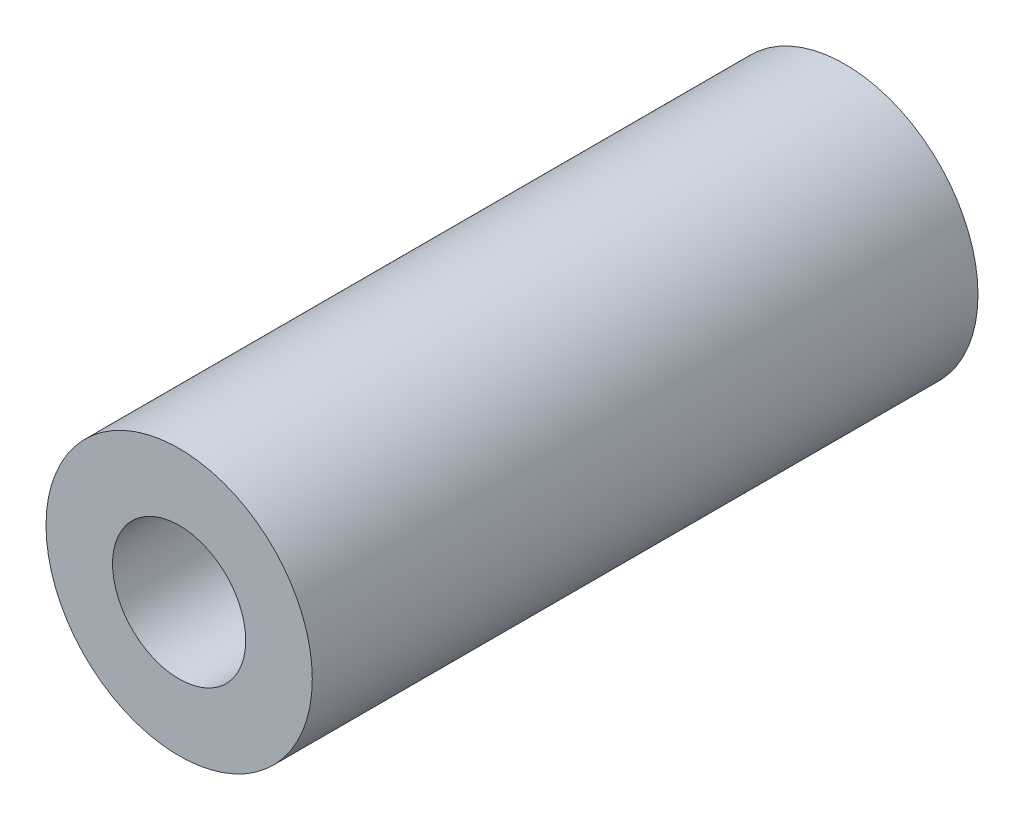
ISO-10303-21;
HEADER;
FILE_DESCRIPTION(('STEP AP214'),'2;1');
FILE_NAME('part.step','',(''),(''),'','','');
FILE_SCHEMA(('AUTOMOTIVE_DESIGN { 1 0 10303 214 1 1 1 1 }'));
ENDSEC;
DATA;
#1=APPLICATION_CONTEXT('core data for automotive mechanical design processes');
#2=APPLICATION_PROTOCOL_DEFINITION('international standard','automotive_design',2000,#1);
#3=PRODUCT_CONTEXT('',#1,'mechanical');
#4=PRODUCT('Part','Part','',(#3));
#5=PRODUCT_RELATED_PRODUCT_CATEGORY('part','',(#4));
#6=PRODUCT_DEFINITION_FORMATION('','',#4);
#7=PRODUCT_DEFINITION_CONTEXT('part definition',#1,'design');
#8=PRODUCT_DEFINITION('design','',#6,#7);
#9=PRODUCT_DEFINITION_SHAPE('','',#8);
#10=(LENGTH_UNIT() NAMED_UNIT(*) SI_UNIT(.MILLI.,.METRE.));
#11=(NAMED_UNIT(*) PLANE_ANGLE_UNIT() SI_UNIT($,.RADIAN.));
#12=(NAMED_UNIT(*) SI_UNIT($,.STERADIAN.) SOLID_ANGLE_UNIT());
#13=UNCERTAINTY_MEASURE_WITH_UNIT(LENGTH_MEASURE(1.E-05),#10,'distance_accuracy_value','');
#14=(GEOMETRIC_REPRESENTATION_CONTEXT(3) GLOBAL_UNCERTAINTY_ASSIGNED_CONTEXT((#13)) GLOBAL_UNIT_ASSIGNED_CONTEXT((#10,
#11,#12)) REPRESENTATION_CONTEXT('',''));
#15=CARTESIAN_POINT('',(0.,0.,0.));
#16=DIRECTION('',(0.,0.,1.));
#17=DIRECTION('',(1.,0.,0.));
#18=AXIS2_PLACEMENT_3D('',#15,#16,#17);
#19=CARTESIAN_POINT('',(0.,0.,25.));
#20=DIRECTION('',(0.,0.,1.));
#21=DIRECTION('',(1.,0.,0.));
#22=AXIS2_PLACEMENT_3D('',#19,#20,#21);
#23=CYLINDRICAL_SURFACE('',#22,10.);
#24=CARTESIAN_POINT('',(0.,0.,-25.));
#25=DIRECTION('',(0.,0.,1.));
#26=DIRECTION('',(1.,0.,0.));
#27=AXIS2_PLACEMENT_3D('',#24,#25,#26);
#28=CIRCLE('',#27,10.);
#29=CARTESIAN_POINT('',(10.,0.,-25.));
#30=VERTEX_POINT('',#29);
#31=EDGE_CURVE('E10',#30,#30,#28,.T.);
#32=ORIENTED_EDGE('',*,*,#31,.T.);
#33=EDGE_LOOP('',(#32));
#34=FACE_BOUND('',#33,.T.);
#35=CARTESIAN_POINT('',(0.,0.,25.));
#36=DIRECTION('',(0.,0.,1.));
#37=DIRECTION('',(1.,0.,0.));
#38=AXIS2_PLACEMENT_3D('',#35,#36,#37);
#39=CIRCLE('',#38,10.);
#40=CARTESIAN_POINT('',(10.,0.,25.));
#41=VERTEX_POINT('',#40);
#42=EDGE_CURVE('E45',#41,#41,#39,.T.);
#43=ORIENTED_EDGE('',*,*,#42,.F.);
#44=EDGE_LOOP('',(#43));
#45=FACE_BOUND('',#44,.T.);
#46=ADVANCED_FACE('F31',(#34,#45),#23,.T.);
#47=CARTESIAN_POINT('',(10.,0.,-25.));
#48=DIRECTION('',(0.,0.,-1.));
#49=DIRECTION('',(-1.,0.,0.));
#50=AXIS2_PLACEMENT_3D('',#47,#48,#49);
#51=PLANE('',#50);
#52=CARTESIAN_POINT('',(0.,0.,-25.));
#53=DIRECTION('',(0.,0.,1.));
#54=DIRECTION('',(1.,0.,0.));
#55=AXIS2_PLACEMENT_3D('',#52,#53,#54);
#56=CIRCLE('',#55,5.);
#57=CARTESIAN_POINT('',(5.,0.,-25.));
#58=VERTEX_POINT('',#57);
#59=EDGE_CURVE('E37',#58,#58,#56,.T.);
#60=ORIENTED_EDGE('',*,*,#59,.T.);
#61=EDGE_LOOP('',(#60));
#62=FACE_BOUND('',#61,.T.);
#63=ORIENTED_EDGE('',*,*,#31,.F.);
#64=EDGE_LOOP('',(#63));
#65=FACE_BOUND('',#64,.T.);
#66=ADVANCED_FACE('F55',(#62,#65),#51,.T.);
#67=CARTESIAN_POINT('',(0.,0.,25.));
#68=DIRECTION('',(0.,0.,1.));
#69=DIRECTION('',(1.,0.,0.));
#70=AXIS2_PLACEMENT_3D('',#67,#68,#69);
#71=CYLINDRICAL_SURFACE('',#70,5.);
#72=CARTESIAN_POINT('',(0.,0.,25.));
#73=DIRECTION('',(0.,0.,1.));
#74=DIRECTION('',(1.,0.,0.));
#75=AXIS2_PLACEMENT_3D('',#72,#73,#74);
#76=CIRCLE('',#75,5.);
#77=CARTESIAN_POINT('',(5.,0.,25.));
#78=VERTEX_POINT('',#77);
#79=EDGE_CURVE('E41',#78,#78,#76,.T.);
#80=ORIENTED_EDGE('',*,*,#79,.T.);
#81=EDGE_LOOP('',(#80));
#82=FACE_BOUND('',#81,.T.);
#83=ORIENTED_EDGE('',*,*,#59,.F.);
#84=EDGE_LOOP('',(#83));
#85=FACE_BOUND('',#84,.T.);
#86=ADVANCED_FACE('F59',(#82,#85),#71,.F.);
#87=CARTESIAN_POINT('',(10.,0.,25.));
#88=DIRECTION('',(0.,0.,1.));
#89=DIRECTION('',(1.,0.,0.));
#90=AXIS2_PLACEMENT_3D('',#87,#88,#89);
#91=PLANE('',#90);
#92=ORIENTED_EDGE('',*,*,#42,.T.);
#93=EDGE_LOOP('',(#92));
#94=FACE_BOUND('',#93,.T.);
#95=ORIENTED_EDGE('',*,*,#79,.F.);
#96=EDGE_LOOP('',(#95));
#97=FACE_BOUND('',#96,.T.);
#98=ADVANCED_FACE('F51',(#94,#97),#91,.T.);
#99=CLOSED_SHELL('',(#46,#66,#86,#98));
#100=MANIFOLD_SOLID_BREP('B2',#99);
#101=ADVANCED_BREP_SHAPE_REPRESENTATION('',(#18,#100),#14);
#102=SHAPE_DEFINITION_REPRESENTATION(#9,#101);
ENDSEC;
END-ISO-10303-21;
